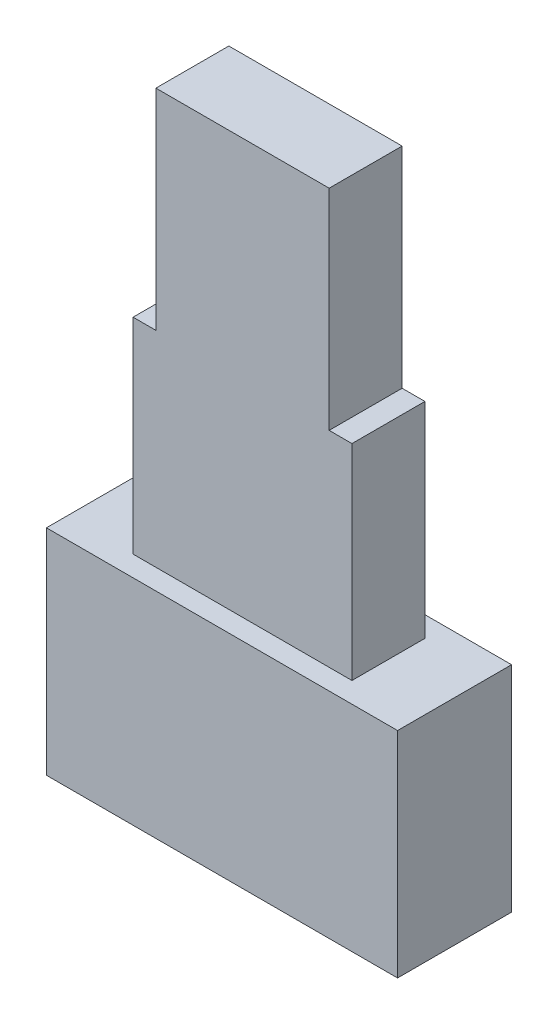
ISO-10303-21;
HEADER;
FILE_DESCRIPTION(('STEP AP214'),'2;1');
FILE_NAME('part.step','',(''),(''),'','','');
FILE_SCHEMA(('AUTOMOTIVE_DESIGN { 1 0 10303 214 1 1 1 1 }'));
ENDSEC;
DATA;
#1=APPLICATION_CONTEXT('core data for automotive mechanical design processes');
#2=APPLICATION_PROTOCOL_DEFINITION('international standard','automotive_design',2000,#1);
#3=PRODUCT_CONTEXT('',#1,'mechanical');
#4=PRODUCT('Part','Part','',(#3));
#5=PRODUCT_RELATED_PRODUCT_CATEGORY('part','',(#4));
#6=PRODUCT_DEFINITION_FORMATION('','',#4);
#7=PRODUCT_DEFINITION_CONTEXT('part definition',#1,'design');
#8=PRODUCT_DEFINITION('design','',#6,#7);
#9=PRODUCT_DEFINITION_SHAPE('','',#8);
#10=(LENGTH_UNIT() NAMED_UNIT(*) SI_UNIT(.MILLI.,.METRE.));
#11=(NAMED_UNIT(*) PLANE_ANGLE_UNIT() SI_UNIT($,.RADIAN.));
#12=(NAMED_UNIT(*) SI_UNIT($,.STERADIAN.) SOLID_ANGLE_UNIT());
#13=UNCERTAINTY_MEASURE_WITH_UNIT(LENGTH_MEASURE(1.E-05),#10,'distance_accuracy_value','');
#14=(GEOMETRIC_REPRESENTATION_CONTEXT(3) GLOBAL_UNCERTAINTY_ASSIGNED_CONTEXT((#13)) GLOBAL_UNIT_ASSIGNED_CONTEXT((#10,
#11,#12)) REPRESENTATION_CONTEXT('',''));
#15=CARTESIAN_POINT('',(0.,0.,0.));
#16=DIRECTION('',(0.,0.,1.));
#17=DIRECTION('',(1.,0.,0.));
#18=AXIS2_PLACEMENT_3D('',#15,#16,#17);
#19=CARTESIAN_POINT('',(0.,9.2,0.));
#20=DIRECTION('',(0.,1.,0.));
#21=DIRECTION('',(0.,0.,1.));
#22=AXIS2_PLACEMENT_3D('',#19,#20,#21);
#23=PLANE('',#22);
#24=DIRECTION('',(0.,0.,1.));
#25=VECTOR('',#24,1.);
#26=CARTESIAN_POINT('',(-1.9,9.2,0.8));
#27=LINE('',#26,#25);
#28=CARTESIAN_POINT('',(-1.9,9.2,-0.8));
#29=VERTEX_POINT('',#28);
#30=CARTESIAN_POINT('',(-1.9,9.2,0.8));
#31=VERTEX_POINT('',#30);
#32=EDGE_CURVE('E50',#29,#31,#27,.T.);
#33=ORIENTED_EDGE('',*,*,#32,.F.);
#34=DIRECTION('',(-1.,0.,0.));
#35=VECTOR('',#34,1.);
#36=CARTESIAN_POINT('',(2.4,9.2,-0.800000000000001));
#37=LINE('',#36,#35);
#38=CARTESIAN_POINT('',(-2.4,9.2,-0.8));
#39=VERTEX_POINT('',#38);
#40=EDGE_CURVE('E163',#29,#39,#37,.T.);
#41=ORIENTED_EDGE('',*,*,#40,.T.);
#42=DIRECTION('',(0.,0.,1.));
#43=VECTOR('',#42,1.);
#44=CARTESIAN_POINT('',(-2.4,9.2,0.8));
#45=LINE('',#44,#43);
#46=CARTESIAN_POINT('',(-2.4,9.2,0.8));
#47=VERTEX_POINT('',#46);
#48=EDGE_CURVE('E154',#39,#47,#45,.T.);
#49=ORIENTED_EDGE('',*,*,#48,.T.);
#50=DIRECTION('',(1.,0.,0.));
#51=VECTOR('',#50,1.);
#52=CARTESIAN_POINT('',(2.4,9.2,0.8));
#53=LINE('',#52,#51);
#54=EDGE_CURVE('E159',#47,#31,#53,.T.);
#55=ORIENTED_EDGE('',*,*,#54,.T.);
#56=EDGE_LOOP('',(#33,#41,#49,#55));
#57=FACE_BOUND('',#56,.T.);
#58=ADVANCED_FACE('F35',(#57),#23,.T.);
#59=CARTESIAN_POINT('',(0.,4.7,0.));
#60=DIRECTION('',(0.,1.,0.));
#61=DIRECTION('',(0.,0.,1.));
#62=AXIS2_PLACEMENT_3D('',#59,#60,#61);
#63=PLANE('',#62);
#64=DIRECTION('',(0.,0.,1.));
#65=VECTOR('',#64,1.);
#66=CARTESIAN_POINT('',(-3.85,4.7,1.25));
#67=LINE('',#66,#65);
#68=CARTESIAN_POINT('',(-3.85,4.7,-1.25));
#69=VERTEX_POINT('',#68);
#70=CARTESIAN_POINT('',(-3.85,4.7,1.25));
#71=VERTEX_POINT('',#70);
#72=EDGE_CURVE('E182',#69,#71,#67,.T.);
#73=ORIENTED_EDGE('',*,*,#72,.T.);
#74=DIRECTION('',(1.,0.,0.));
#75=VECTOR('',#74,1.);
#76=CARTESIAN_POINT('',(3.85,4.7,1.25));
#77=LINE('',#76,#75);
#78=CARTESIAN_POINT('',(3.85,4.7,1.25));
#79=VERTEX_POINT('',#78);
#80=EDGE_CURVE('E185',#71,#79,#77,.T.);
#81=ORIENTED_EDGE('',*,*,#80,.T.);
#82=DIRECTION('',(0.,0.,-1.));
#83=VECTOR('',#82,1.);
#84=CARTESIAN_POINT('',(3.85,4.7,1.25));
#85=LINE('',#84,#83);
#86=CARTESIAN_POINT('',(3.85,4.7,-1.25));
#87=VERTEX_POINT('',#86);
#88=EDGE_CURVE('E188',#79,#87,#85,.T.);
#89=ORIENTED_EDGE('',*,*,#88,.T.);
#90=DIRECTION('',(-1.,0.,0.));
#91=VECTOR('',#90,1.);
#92=CARTESIAN_POINT('',(3.85,4.7,-1.25));
#93=LINE('',#92,#91);
#94=EDGE_CURVE('E190',#87,#69,#93,.T.);
#95=ORIENTED_EDGE('',*,*,#94,.T.);
#96=EDGE_LOOP('',(#73,#81,#89,#95));
#97=FACE_BOUND('',#96,.T.);
#98=DIRECTION('',(1.,0.,0.));
#99=VECTOR('',#98,1.);
#100=CARTESIAN_POINT('',(2.4,4.7,0.8));
#101=LINE('',#100,#99);
#102=CARTESIAN_POINT('',(-2.4,4.7,0.8));
#103=VERTEX_POINT('',#102);
#104=CARTESIAN_POINT('',(2.4,4.7,0.8));
#105=VERTEX_POINT('',#104);
#106=EDGE_CURVE('E148',#103,#105,#101,.T.);
#107=ORIENTED_EDGE('',*,*,#106,.F.);
#108=DIRECTION('',(0.,0.,1.));
#109=VECTOR('',#108,1.);
#110=CARTESIAN_POINT('',(-2.4,4.7,0.8));
#111=LINE('',#110,#109);
#112=CARTESIAN_POINT('',(-2.4,4.7,-0.8));
#113=VERTEX_POINT('',#112);
#114=EDGE_CURVE('E145',#113,#103,#111,.T.);
#115=ORIENTED_EDGE('',*,*,#114,.F.);
#116=DIRECTION('',(-1.,0.,0.));
#117=VECTOR('',#116,1.);
#118=CARTESIAN_POINT('',(2.4,4.7,-0.800000000000001));
#119=LINE('',#118,#117);
#120=CARTESIAN_POINT('',(2.4,4.7,-0.800000000000001));
#121=VERTEX_POINT('',#120);
#122=EDGE_CURVE('E158',#121,#113,#119,.T.);
#123=ORIENTED_EDGE('',*,*,#122,.F.);
#124=DIRECTION('',(0.,0.,-1.));
#125=VECTOR('',#124,1.);
#126=CARTESIAN_POINT('',(2.4,4.7,0.8));
#127=LINE('',#126,#125);
#128=EDGE_CURVE('E168',#105,#121,#127,.T.);
#129=ORIENTED_EDGE('',*,*,#128,.F.);
#130=EDGE_LOOP('',(#107,#115,#123,#129));
#131=FACE_BOUND('',#130,.T.);
#132=ADVANCED_FACE('F224',(#97,#131),#63,.T.);
#133=CARTESIAN_POINT('',(-3.85,4.7,1.25));
#134=DIRECTION('',(1.,0.,0.));
#135=DIRECTION('',(0.,0.,-1.));
#136=AXIS2_PLACEMENT_3D('',#133,#134,#135);
#137=PLANE('',#136);
#138=DIRECTION('',(0.,0.,1.));
#139=VECTOR('',#138,1.);
#140=CARTESIAN_POINT('',(-3.85,0.,1.25));
#141=LINE('',#140,#139);
#142=CARTESIAN_POINT('',(-3.85,0.,-1.25));
#143=VERTEX_POINT('',#142);
#144=CARTESIAN_POINT('',(-3.85,0.,1.25));
#145=VERTEX_POINT('',#144);
#146=EDGE_CURVE('E181',#143,#145,#141,.T.);
#147=ORIENTED_EDGE('',*,*,#146,.T.);
#148=DIRECTION('',(0.,-1.,0.));
#149=VECTOR('',#148,1.);
#150=CARTESIAN_POINT('',(-3.85,4.7,1.25));
#151=LINE('',#150,#149);
#152=EDGE_CURVE('E11',#71,#145,#151,.T.);
#153=ORIENTED_EDGE('',*,*,#152,.F.);
#154=ORIENTED_EDGE('',*,*,#72,.F.);
#155=DIRECTION('',(0.,-1.,0.));
#156=VECTOR('',#155,1.);
#157=CARTESIAN_POINT('',(-3.85,4.7,-1.25));
#158=LINE('',#157,#156);
#159=EDGE_CURVE('E192',#69,#143,#158,.T.);
#160=ORIENTED_EDGE('',*,*,#159,.T.);
#161=EDGE_LOOP('',(#147,#153,#154,#160));
#162=FACE_BOUND('',#161,.T.);
#163=ADVANCED_FACE('F37',(#162),#137,.F.);
#164=CARTESIAN_POINT('',(3.85,4.7,1.25));
#165=DIRECTION('',(0.,0.,-1.));
#166=DIRECTION('',(-1.,0.,0.));
#167=AXIS2_PLACEMENT_3D('',#164,#165,#166);
#168=PLANE('',#167);
#169=DIRECTION('',(1.,0.,0.));
#170=VECTOR('',#169,1.);
#171=CARTESIAN_POINT('',(3.85,0.,1.25));
#172=LINE('',#171,#170);
#173=CARTESIAN_POINT('',(3.85,0.,1.25));
#174=VERTEX_POINT('',#173);
#175=EDGE_CURVE('E195',#145,#174,#172,.T.);
#176=ORIENTED_EDGE('',*,*,#175,.T.);
#177=DIRECTION('',(0.,-1.,0.));
#178=VECTOR('',#177,1.);
#179=CARTESIAN_POINT('',(3.85,4.7,1.25));
#180=LINE('',#179,#178);
#181=EDGE_CURVE('E43',#79,#174,#180,.T.);
#182=ORIENTED_EDGE('',*,*,#181,.F.);
#183=ORIENTED_EDGE('',*,*,#80,.F.);
#184=ORIENTED_EDGE('',*,*,#152,.T.);
#185=EDGE_LOOP('',(#176,#182,#183,#184));
#186=FACE_BOUND('',#185,.T.);
#187=ADVANCED_FACE('F226',(#186),#168,.F.);
#188=CARTESIAN_POINT('',(3.85,4.7,1.25));
#189=DIRECTION('',(-1.,0.,0.));
#190=DIRECTION('',(0.,0.,1.));
#191=AXIS2_PLACEMENT_3D('',#188,#189,#190);
#192=PLANE('',#191);
#193=DIRECTION('',(0.,0.,-1.));
#194=VECTOR('',#193,1.);
#195=CARTESIAN_POINT('',(3.85,0.,1.25));
#196=LINE('',#195,#194);
#197=CARTESIAN_POINT('',(3.85,0.,-1.25));
#198=VERTEX_POINT('',#197);
#199=EDGE_CURVE('E197',#174,#198,#196,.T.);
#200=ORIENTED_EDGE('',*,*,#199,.T.);
#201=DIRECTION('',(0.,-1.,0.));
#202=VECTOR('',#201,1.);
#203=CARTESIAN_POINT('',(3.85,4.7,-1.25));
#204=LINE('',#203,#202);
#205=EDGE_CURVE('E202',#87,#198,#204,.T.);
#206=ORIENTED_EDGE('',*,*,#205,.F.);
#207=ORIENTED_EDGE('',*,*,#88,.F.);
#208=ORIENTED_EDGE('',*,*,#181,.T.);
#209=EDGE_LOOP('',(#200,#206,#207,#208));
#210=FACE_BOUND('',#209,.T.);
#211=ADVANCED_FACE('F209',(#210),#192,.F.);
#212=CARTESIAN_POINT('',(3.85,4.7,-1.25));
#213=DIRECTION('',(0.,0.,1.));
#214=DIRECTION('',(1.,0.,0.));
#215=AXIS2_PLACEMENT_3D('',#212,#213,#214);
#216=PLANE('',#215);
#217=DIRECTION('',(-1.,0.,0.));
#218=VECTOR('',#217,1.);
#219=CARTESIAN_POINT('',(3.85,0.,-1.25));
#220=LINE('',#219,#218);
#221=EDGE_CURVE('E186',#198,#143,#220,.T.);
#222=ORIENTED_EDGE('',*,*,#221,.T.);
#223=ORIENTED_EDGE('',*,*,#159,.F.);
#224=ORIENTED_EDGE('',*,*,#94,.F.);
#225=ORIENTED_EDGE('',*,*,#205,.T.);
#226=EDGE_LOOP('',(#222,#223,#224,#225));
#227=FACE_BOUND('',#226,.T.);
#228=ADVANCED_FACE('F218',(#227),#216,.F.);
#229=CARTESIAN_POINT('',(0.,0.,0.));
#230=DIRECTION('',(0.,1.,0.));
#231=DIRECTION('',(0.,0.,1.));
#232=AXIS2_PLACEMENT_3D('',#229,#230,#231);
#233=PLANE('',#232);
#234=ORIENTED_EDGE('',*,*,#146,.F.);
#235=ORIENTED_EDGE('',*,*,#221,.F.);
#236=ORIENTED_EDGE('',*,*,#199,.F.);
#237=ORIENTED_EDGE('',*,*,#175,.F.);
#238=EDGE_LOOP('',(#234,#235,#236,#237));
#239=FACE_BOUND('',#238,.T.);
#240=ADVANCED_FACE('F215',(#239),#233,.F.);
#241=CARTESIAN_POINT('',(-2.4,9.2,0.8));
#242=DIRECTION('',(1.,0.,0.));
#243=DIRECTION('',(0.,0.,-1.));
#244=AXIS2_PLACEMENT_3D('',#241,#242,#243);
#245=PLANE('',#244);
#246=ORIENTED_EDGE('',*,*,#114,.T.);
#247=DIRECTION('',(0.,-1.,0.));
#248=VECTOR('',#247,1.);
#249=CARTESIAN_POINT('',(-2.4,9.2,0.8));
#250=LINE('',#249,#248);
#251=EDGE_CURVE('E179',#47,#103,#250,.T.);
#252=ORIENTED_EDGE('',*,*,#251,.F.);
#253=ORIENTED_EDGE('',*,*,#48,.F.);
#254=DIRECTION('',(0.,-1.,0.));
#255=VECTOR('',#254,1.);
#256=CARTESIAN_POINT('',(-2.4,9.2,-0.8));
#257=LINE('',#256,#255);
#258=EDGE_CURVE('E165',#39,#113,#257,.T.);
#259=ORIENTED_EDGE('',*,*,#258,.T.);
#260=EDGE_LOOP('',(#246,#252,#253,#259));
#261=FACE_BOUND('',#260,.T.);
#262=ADVANCED_FACE('F259',(#261),#245,.F.);
#263=CARTESIAN_POINT('',(2.4,9.2,0.8));
#264=DIRECTION('',(0.,0.,-1.));
#265=DIRECTION('',(-1.,0.,0.));
#266=AXIS2_PLACEMENT_3D('',#263,#264,#265);
#267=PLANE('',#266);
#268=ORIENTED_EDGE('',*,*,#106,.T.);
#269=DIRECTION('',(0.,-1.,0.));
#270=VECTOR('',#269,1.);
#271=CARTESIAN_POINT('',(2.4,9.2,0.8));
#272=LINE('',#271,#270);
#273=CARTESIAN_POINT('',(2.4,9.2,0.8));
#274=VERTEX_POINT('',#273);
#275=EDGE_CURVE('E176',#274,#105,#272,.T.);
#276=ORIENTED_EDGE('',*,*,#275,.F.);
#277=CARTESIAN_POINT('',(1.9,9.2,0.8));
#278=VERTEX_POINT('',#277);
#279=EDGE_CURVE('E157',#278,#274,#53,.T.);
#280=ORIENTED_EDGE('',*,*,#279,.F.);
#281=DIRECTION('',(0.,-1.,0.));
#282=VECTOR('',#281,1.);
#283=CARTESIAN_POINT('',(1.9,13.8,0.8));
#284=LINE('',#283,#282);
#285=CARTESIAN_POINT('',(1.9,13.8,0.8));
#286=VERTEX_POINT('',#285);
#287=EDGE_CURVE('E130',#286,#278,#284,.T.);
#288=ORIENTED_EDGE('',*,*,#287,.F.);
#289=DIRECTION('',(1.,0.,0.));
#290=VECTOR('',#289,1.);
#291=CARTESIAN_POINT('',(1.9,13.8,0.8));
#292=LINE('',#291,#290);
#293=CARTESIAN_POINT('',(-1.9,13.8,0.8));
#294=VERTEX_POINT('',#293);
#295=EDGE_CURVE('E124',#294,#286,#292,.T.);
#296=ORIENTED_EDGE('',*,*,#295,.F.);
#297=DIRECTION('',(0.,-1.,0.));
#298=VECTOR('',#297,1.);
#299=CARTESIAN_POINT('',(-1.9,13.8,0.8));
#300=LINE('',#299,#298);
#301=EDGE_CURVE('E128',#294,#31,#300,.T.);
#302=ORIENTED_EDGE('',*,*,#301,.T.);
#303=ORIENTED_EDGE('',*,*,#54,.F.);
#304=ORIENTED_EDGE('',*,*,#251,.T.);
#305=EDGE_LOOP('',(#268,#276,#280,#288,#296,#302,#303,#304));
#306=FACE_BOUND('',#305,.T.);
#307=ADVANCED_FACE('F126',(#306),#267,.F.);
#308=CARTESIAN_POINT('',(2.4,9.2,0.8));
#309=DIRECTION('',(-1.,0.,0.));
#310=DIRECTION('',(0.,0.,1.));
#311=AXIS2_PLACEMENT_3D('',#308,#309,#310);
#312=PLANE('',#311);
#313=ORIENTED_EDGE('',*,*,#128,.T.);
#314=DIRECTION('',(0.,-1.,0.));
#315=VECTOR('',#314,1.);
#316=CARTESIAN_POINT('',(2.4,9.2,-0.800000000000001));
#317=LINE('',#316,#315);
#318=CARTESIAN_POINT('',(2.4,9.2,-0.800000000000001));
#319=VERTEX_POINT('',#318);
#320=EDGE_CURVE('E174',#319,#121,#317,.T.);
#321=ORIENTED_EDGE('',*,*,#320,.F.);
#322=DIRECTION('',(0.,0.,-1.));
#323=VECTOR('',#322,1.);
#324=CARTESIAN_POINT('',(2.4,9.2,0.8));
#325=LINE('',#324,#323);
#326=EDGE_CURVE('E161',#274,#319,#325,.T.);
#327=ORIENTED_EDGE('',*,*,#326,.F.);
#328=ORIENTED_EDGE('',*,*,#275,.T.);
#329=EDGE_LOOP('',(#313,#321,#327,#328));
#330=FACE_BOUND('',#329,.T.);
#331=ADVANCED_FACE('F249',(#330),#312,.F.);
#332=CARTESIAN_POINT('',(2.4,9.2,-0.800000000000001));
#333=DIRECTION('',(0.,0.,1.));
#334=DIRECTION('',(1.,0.,0.));
#335=AXIS2_PLACEMENT_3D('',#332,#333,#334);
#336=PLANE('',#335);
#337=ORIENTED_EDGE('',*,*,#122,.T.);
#338=ORIENTED_EDGE('',*,*,#258,.F.);
#339=ORIENTED_EDGE('',*,*,#40,.F.);
#340=DIRECTION('',(0.,-1.,0.));
#341=VECTOR('',#340,1.);
#342=CARTESIAN_POINT('',(-1.9,13.8,-0.8));
#343=LINE('',#342,#341);
#344=CARTESIAN_POINT('',(-1.9,13.8,-0.8));
#345=VERTEX_POINT('',#344);
#346=EDGE_CURVE('E337',#345,#29,#343,.T.);
#347=ORIENTED_EDGE('',*,*,#346,.F.);
#348=DIRECTION('',(-1.,0.,0.));
#349=VECTOR('',#348,1.);
#350=CARTESIAN_POINT('',(1.9,13.8,-0.8));
#351=LINE('',#350,#349);
#352=CARTESIAN_POINT('',(1.9,13.8,-0.8));
#353=VERTEX_POINT('',#352);
#354=EDGE_CURVE('E139',#353,#345,#351,.T.);
#355=ORIENTED_EDGE('',*,*,#354,.F.);
#356=DIRECTION('',(0.,-1.,0.));
#357=VECTOR('',#356,1.);
#358=CARTESIAN_POINT('',(1.9,13.8,-0.8));
#359=LINE('',#358,#357);
#360=CARTESIAN_POINT('',(1.9,9.2,-0.8));
#361=VERTEX_POINT('',#360);
#362=EDGE_CURVE('E150',#353,#361,#359,.T.);
#363=ORIENTED_EDGE('',*,*,#362,.T.);
#364=EDGE_CURVE('E164',#319,#361,#37,.T.);
#365=ORIENTED_EDGE('',*,*,#364,.F.);
#366=ORIENTED_EDGE('',*,*,#320,.T.);
#367=EDGE_LOOP('',(#337,#338,#339,#347,#355,#363,#365,#366));
#368=FACE_BOUND('',#367,.T.);
#369=ADVANCED_FACE('F243',(#368),#336,.F.);
#370=DIRECTION('',(0.,0.,-1.));
#371=VECTOR('',#370,1.);
#372=CARTESIAN_POINT('',(1.9,9.2,0.8));
#373=LINE('',#372,#371);
#374=EDGE_CURVE('E58',#278,#361,#373,.T.);
#375=ORIENTED_EDGE('',*,*,#374,.F.);
#376=ORIENTED_EDGE('',*,*,#279,.T.);
#377=ORIENTED_EDGE('',*,*,#326,.T.);
#378=ORIENTED_EDGE('',*,*,#364,.T.);
#379=EDGE_LOOP('',(#375,#376,#377,#378));
#380=FACE_BOUND('',#379,.T.);
#381=ADVANCED_FACE('F235',(#380),#23,.T.);
#382=CARTESIAN_POINT('',(-1.9,13.8,0.8));
#383=DIRECTION('',(1.,0.,0.));
#384=DIRECTION('',(0.,0.,-1.));
#385=AXIS2_PLACEMENT_3D('',#382,#383,#384);
#386=PLANE('',#385);
#387=ORIENTED_EDGE('',*,*,#32,.T.);
#388=ORIENTED_EDGE('',*,*,#301,.F.);
#389=DIRECTION('',(0.,0.,1.));
#390=VECTOR('',#389,1.);
#391=CARTESIAN_POINT('',(-1.9,13.8,0.8));
#392=LINE('',#391,#390);
#393=EDGE_CURVE('E134',#345,#294,#392,.T.);
#394=ORIENTED_EDGE('',*,*,#393,.F.);
#395=ORIENTED_EDGE('',*,*,#346,.T.);
#396=EDGE_LOOP('',(#387,#388,#394,#395));
#397=FACE_BOUND('',#396,.T.);
#398=ADVANCED_FACE('F144',(#397),#386,.F.);
#399=CARTESIAN_POINT('',(1.9,13.8,0.8));
#400=DIRECTION('',(-1.,0.,0.));
#401=DIRECTION('',(0.,0.,1.));
#402=AXIS2_PLACEMENT_3D('',#399,#400,#401);
#403=PLANE('',#402);
#404=ORIENTED_EDGE('',*,*,#374,.T.);
#405=ORIENTED_EDGE('',*,*,#362,.F.);
#406=DIRECTION('',(0.,0.,-1.));
#407=VECTOR('',#406,1.);
#408=CARTESIAN_POINT('',(1.9,13.8,0.8));
#409=LINE('',#408,#407);
#410=EDGE_CURVE('E133',#286,#353,#409,.T.);
#411=ORIENTED_EDGE('',*,*,#410,.F.);
#412=ORIENTED_EDGE('',*,*,#287,.T.);
#413=EDGE_LOOP('',(#404,#405,#411,#412));
#414=FACE_BOUND('',#413,.T.);
#415=ADVANCED_FACE('F248',(#414),#403,.F.);
#416=CARTESIAN_POINT('',(0.,13.8,0.));
#417=DIRECTION('',(0.,1.,0.));
#418=DIRECTION('',(0.,0.,1.));
#419=AXIS2_PLACEMENT_3D('',#416,#417,#418);
#420=PLANE('',#419);
#421=ORIENTED_EDGE('',*,*,#393,.T.);
#422=ORIENTED_EDGE('',*,*,#295,.T.);
#423=ORIENTED_EDGE('',*,*,#410,.T.);
#424=ORIENTED_EDGE('',*,*,#354,.T.);
#425=EDGE_LOOP('',(#421,#422,#423,#424));
#426=FACE_BOUND('',#425,.T.);
#427=ADVANCED_FACE('F137',(#426),#420,.T.);
#428=CLOSED_SHELL('',(#58,#132,#163,#187,#211,#228,#240,#262,#307,#331,#369,#381,#398,#415,#427));
#429=MANIFOLD_SOLID_BREP('B2',#428);
#430=ADVANCED_BREP_SHAPE_REPRESENTATION('',(#18,#429),#14);
#431=SHAPE_DEFINITION_REPRESENTATION(#9,#430);
ENDSEC;
END-ISO-10303-21;
